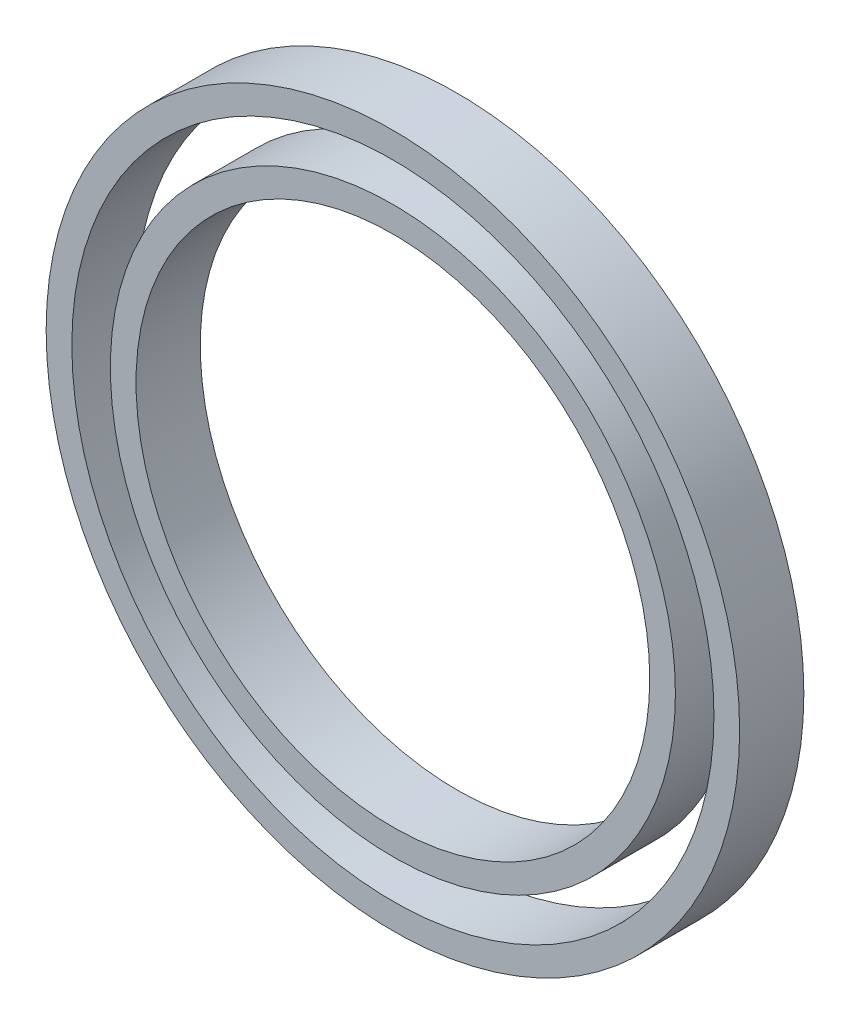
ISO-10303-21;
HEADER;
FILE_DESCRIPTION(('STEP AP214'),'2;1');
FILE_NAME('part.step','',(''),(''),'','','');
FILE_SCHEMA(('AUTOMOTIVE_DESIGN { 1 0 10303 214 1 1 1 1 }'));
ENDSEC;
DATA;
#1=APPLICATION_CONTEXT('core data for automotive mechanical design processes');
#2=APPLICATION_PROTOCOL_DEFINITION('international standard','automotive_design',2000,#1);
#3=PRODUCT_CONTEXT('',#1,'mechanical');
#4=PRODUCT('Part','Part','',(#3));
#5=PRODUCT_RELATED_PRODUCT_CATEGORY('part','',(#4));
#6=PRODUCT_DEFINITION_FORMATION('','',#4);
#7=PRODUCT_DEFINITION_CONTEXT('part definition',#1,'design');
#8=PRODUCT_DEFINITION('design','',#6,#7);
#9=PRODUCT_DEFINITION_SHAPE('','',#8);
#10=(LENGTH_UNIT() NAMED_UNIT(*) SI_UNIT(.MILLI.,.METRE.));
#11=(NAMED_UNIT(*) PLANE_ANGLE_UNIT() SI_UNIT($,.RADIAN.));
#12=(NAMED_UNIT(*) SI_UNIT($,.STERADIAN.) SOLID_ANGLE_UNIT());
#13=UNCERTAINTY_MEASURE_WITH_UNIT(LENGTH_MEASURE(1.E-05),#10,'distance_accuracy_value','');
#14=(GEOMETRIC_REPRESENTATION_CONTEXT(3) GLOBAL_UNCERTAINTY_ASSIGNED_CONTEXT((#13)) GLOBAL_UNIT_ASSIGNED_CONTEXT((#10,
#11,#12)) REPRESENTATION_CONTEXT('',''));
#15=CARTESIAN_POINT('',(0.,0.,0.));
#16=DIRECTION('',(0.,0.,1.));
#17=DIRECTION('',(1.,0.,0.));
#18=AXIS2_PLACEMENT_3D('',#15,#16,#17);
#19=CARTESIAN_POINT('',(0.,0.,5.));
#20=DIRECTION('',(0.,0.,1.));
#21=DIRECTION('',(1.,0.,0.));
#22=AXIS2_PLACEMENT_3D('',#19,#20,#21);
#23=PLANE('',#22);
#24=CARTESIAN_POINT('',(0.,0.,5.));
#25=DIRECTION('',(0.,0.,1.));
#26=DIRECTION('',(1.,0.,0.));
#27=AXIS2_PLACEMENT_3D('',#24,#25,#26);
#28=CIRCLE('',#27,22.);
#29=CARTESIAN_POINT('',(22.,0.,5.));
#30=VERTEX_POINT('',#29);
#31=EDGE_CURVE('E92',#30,#30,#28,.T.);
#32=ORIENTED_EDGE('',*,*,#31,.T.);
#33=EDGE_LOOP('',(#32));
#34=FACE_BOUND('',#33,.T.);
#35=CARTESIAN_POINT('',(0.,0.,5.));
#36=DIRECTION('',(0.,0.,1.));
#37=DIRECTION('',(1.,0.,0.));
#38=AXIS2_PLACEMENT_3D('',#35,#36,#37);
#39=CIRCLE('',#38,20.);
#40=CARTESIAN_POINT('',(20.,0.,5.));
#41=VERTEX_POINT('',#40);
#42=EDGE_CURVE('E83',#41,#41,#39,.T.);
#43=ORIENTED_EDGE('',*,*,#42,.F.);
#44=EDGE_LOOP('',(#43));
#45=FACE_BOUND('',#44,.T.);
#46=ADVANCED_FACE('F79',(#34,#45),#23,.T.);
#47=CARTESIAN_POINT('',(0.,0.,0.));
#48=DIRECTION('',(0.,0.,1.));
#49=DIRECTION('',(1.,0.,0.));
#50=AXIS2_PLACEMENT_3D('',#47,#48,#49);
#51=PLANE('',#50);
#52=CARTESIAN_POINT('',(0.,0.,0.));
#53=DIRECTION('',(0.,0.,1.));
#54=DIRECTION('',(1.,0.,0.));
#55=AXIS2_PLACEMENT_3D('',#52,#53,#54);
#56=CIRCLE('',#55,22.);
#57=CARTESIAN_POINT('',(22.,0.,0.));
#58=VERTEX_POINT('',#57);
#59=EDGE_CURVE('E90',#58,#58,#56,.T.);
#60=ORIENTED_EDGE('',*,*,#59,.F.);
#61=EDGE_LOOP('',(#60));
#62=FACE_BOUND('',#61,.T.);
#63=CARTESIAN_POINT('',(0.,0.,0.));
#64=DIRECTION('',(0.,0.,1.));
#65=DIRECTION('',(1.,0.,0.));
#66=AXIS2_PLACEMENT_3D('',#63,#64,#65);
#67=CIRCLE('',#66,20.);
#68=CARTESIAN_POINT('',(20.,0.,0.));
#69=VERTEX_POINT('',#68);
#70=EDGE_CURVE('E12',#69,#69,#67,.T.);
#71=ORIENTED_EDGE('',*,*,#70,.T.);
#72=EDGE_LOOP('',(#71));
#73=FACE_BOUND('',#72,.T.);
#74=ADVANCED_FACE('F100',(#62,#73),#51,.F.);
#75=CARTESIAN_POINT('',(0.,0.,5.));
#76=DIRECTION('',(0.,0.,-1.));
#77=DIRECTION('',(-1.,0.,0.));
#78=AXIS2_PLACEMENT_3D('',#75,#76,#77);
#79=CYLINDRICAL_SURFACE('',#78,22.);
#80=ORIENTED_EDGE('',*,*,#31,.F.);
#81=EDGE_LOOP('',(#80));
#82=FACE_BOUND('',#81,.T.);
#83=ORIENTED_EDGE('',*,*,#59,.T.);
#84=EDGE_LOOP('',(#83));
#85=FACE_BOUND('',#84,.T.);
#86=ADVANCED_FACE('F98',(#82,#85),#79,.T.);
#87=CARTESIAN_POINT('',(0.,0.,5.));
#88=DIRECTION('',(0.,0.,-1.));
#89=DIRECTION('',(-1.,0.,0.));
#90=AXIS2_PLACEMENT_3D('',#87,#88,#89);
#91=CYLINDRICAL_SURFACE('',#90,20.);
#92=ORIENTED_EDGE('',*,*,#42,.T.);
#93=EDGE_LOOP('',(#92));
#94=FACE_BOUND('',#93,.T.);
#95=ORIENTED_EDGE('',*,*,#70,.F.);
#96=EDGE_LOOP('',(#95));
#97=FACE_BOUND('',#96,.T.);
#98=ADVANCED_FACE('F81',(#94,#97),#91,.F.);
#99=CLOSED_SHELL('',(#46,#74,#86,#98));
#100=MANIFOLD_SOLID_BREP('B2',#99);
#101=CARTESIAN_POINT('',(0.,0.,5.));
#102=DIRECTION('',(0.,0.,1.));
#103=DIRECTION('',(1.,0.,0.));
#104=AXIS2_PLACEMENT_3D('',#101,#102,#103);
#105=PLANE('',#104);
#106=CARTESIAN_POINT('',(0.,0.,5.));
#107=DIRECTION('',(0.,0.,1.));
#108=DIRECTION('',(1.,0.,0.));
#109=AXIS2_PLACEMENT_3D('',#106,#107,#108);
#110=CIRCLE('',#109,27.);
#111=CARTESIAN_POINT('',(27.,0.,5.));
#112=VERTEX_POINT('',#111);
#113=EDGE_CURVE('E78',#112,#112,#110,.T.);
#114=ORIENTED_EDGE('',*,*,#113,.T.);
#115=EDGE_LOOP('',(#114));
#116=FACE_BOUND('',#115,.T.);
#117=CARTESIAN_POINT('',(0.,0.,5.));
#118=DIRECTION('',(0.,0.,1.));
#119=DIRECTION('',(1.,0.,0.));
#120=AXIS2_PLACEMENT_3D('',#117,#118,#119);
#121=CIRCLE('',#120,25.);
#122=CARTESIAN_POINT('',(25.,0.,5.));
#123=VERTEX_POINT('',#122);
#124=EDGE_CURVE('E152',#123,#123,#121,.T.);
#125=ORIENTED_EDGE('',*,*,#124,.F.);
#126=EDGE_LOOP('',(#125));
#127=FACE_BOUND('',#126,.T.);
#128=ADVANCED_FACE('F141',(#116,#127),#105,.T.);
#129=CARTESIAN_POINT('',(0.,0.,0.));
#130=DIRECTION('',(0.,0.,1.));
#131=DIRECTION('',(1.,0.,0.));
#132=AXIS2_PLACEMENT_3D('',#129,#130,#131);
#133=PLANE('',#132);
#134=CARTESIAN_POINT('',(0.,0.,0.));
#135=DIRECTION('',(0.,0.,1.));
#136=DIRECTION('',(1.,0.,0.));
#137=AXIS2_PLACEMENT_3D('',#134,#135,#136);
#138=CIRCLE('',#137,27.);
#139=CARTESIAN_POINT('',(27.,0.,0.));
#140=VERTEX_POINT('',#139);
#141=EDGE_CURVE('E145',#140,#140,#138,.T.);
#142=ORIENTED_EDGE('',*,*,#141,.F.);
#143=EDGE_LOOP('',(#142));
#144=FACE_BOUND('',#143,.T.);
#145=CARTESIAN_POINT('',(0.,0.,0.));
#146=DIRECTION('',(0.,0.,1.));
#147=DIRECTION('',(1.,0.,0.));
#148=AXIS2_PLACEMENT_3D('',#145,#146,#147);
#149=CIRCLE('',#148,25.);
#150=CARTESIAN_POINT('',(25.,0.,0.));
#151=VERTEX_POINT('',#150);
#152=EDGE_CURVE('E154',#151,#151,#149,.T.);
#153=ORIENTED_EDGE('',*,*,#152,.T.);
#154=EDGE_LOOP('',(#153));
#155=FACE_BOUND('',#154,.T.);
#156=ADVANCED_FACE('F164',(#144,#155),#133,.F.);
#157=CARTESIAN_POINT('',(0.,0.,5.));
#158=DIRECTION('',(0.,0.,-1.));
#159=DIRECTION('',(-1.,0.,0.));
#160=AXIS2_PLACEMENT_3D('',#157,#158,#159);
#161=CYLINDRICAL_SURFACE('',#160,27.);
#162=ORIENTED_EDGE('',*,*,#113,.F.);
#163=EDGE_LOOP('',(#162));
#164=FACE_BOUND('',#163,.T.);
#165=ORIENTED_EDGE('',*,*,#141,.T.);
#166=EDGE_LOOP('',(#165));
#167=FACE_BOUND('',#166,.T.);
#168=ADVANCED_FACE('F143',(#164,#167),#161,.T.);
#169=CARTESIAN_POINT('',(0.,0.,5.));
#170=DIRECTION('',(0.,0.,-1.));
#171=DIRECTION('',(-1.,0.,0.));
#172=AXIS2_PLACEMENT_3D('',#169,#170,#171);
#173=CYLINDRICAL_SURFACE('',#172,25.);
#174=ORIENTED_EDGE('',*,*,#124,.T.);
#175=EDGE_LOOP('',(#174));
#176=FACE_BOUND('',#175,.T.);
#177=ORIENTED_EDGE('',*,*,#152,.F.);
#178=EDGE_LOOP('',(#177));
#179=FACE_BOUND('',#178,.T.);
#180=ADVANCED_FACE('F160',(#176,#179),#173,.F.);
#181=CLOSED_SHELL('',(#128,#156,#168,#180));
#182=MANIFOLD_SOLID_BREP('B7',#181);
#183=ADVANCED_BREP_SHAPE_REPRESENTATION('',(#18,#100,#182),#14);
#184=SHAPE_DEFINITION_REPRESENTATION(#9,#183);
ENDSEC;
END-ISO-10303-21;
